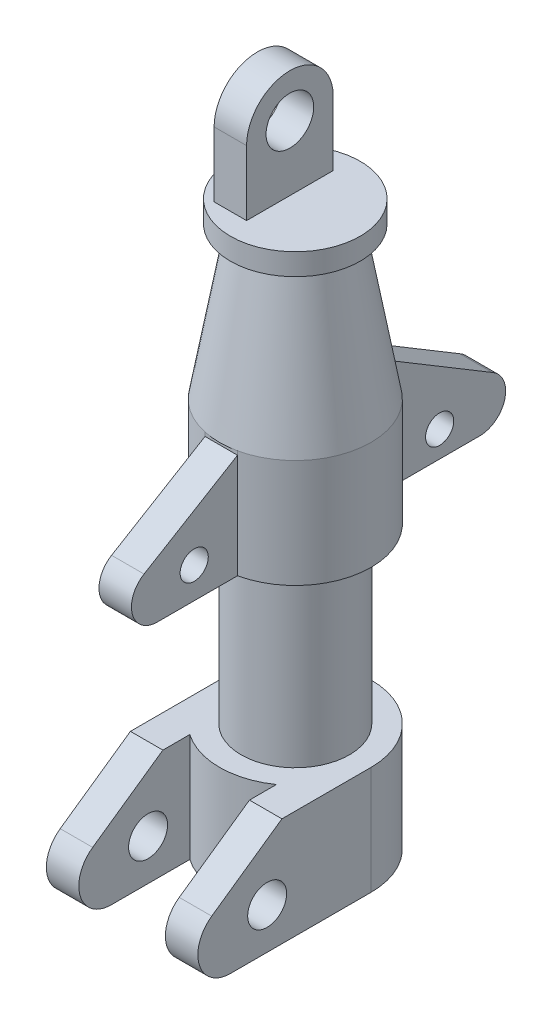
ISO-10303-21;
HEADER;
FILE_DESCRIPTION(('STEP AP214'),'2;1');
FILE_NAME('part.step','',(''),(''),'','','');
FILE_SCHEMA(('AUTOMOTIVE_DESIGN { 1 0 10303 214 1 1 1 1 }'));
ENDSEC;
DATA;
#1=APPLICATION_CONTEXT('core data for automotive mechanical design processes');
#2=APPLICATION_PROTOCOL_DEFINITION('international standard','automotive_design',2000,#1);
#3=PRODUCT_CONTEXT('',#1,'mechanical');
#4=PRODUCT('Part','Part','',(#3));
#5=PRODUCT_RELATED_PRODUCT_CATEGORY('part','',(#4));
#6=PRODUCT_DEFINITION_FORMATION('','',#4);
#7=PRODUCT_DEFINITION_CONTEXT('part definition',#1,'design');
#8=PRODUCT_DEFINITION('design','',#6,#7);
#9=PRODUCT_DEFINITION_SHAPE('','',#8);
#10=(LENGTH_UNIT() NAMED_UNIT(*) SI_UNIT(.MILLI.,.METRE.));
#11=(NAMED_UNIT(*) PLANE_ANGLE_UNIT() SI_UNIT($,.RADIAN.));
#12=(NAMED_UNIT(*) SI_UNIT($,.STERADIAN.) SOLID_ANGLE_UNIT());
#13=UNCERTAINTY_MEASURE_WITH_UNIT(LENGTH_MEASURE(1.E-05),#10,'distance_accuracy_value','');
#14=(GEOMETRIC_REPRESENTATION_CONTEXT(3) GLOBAL_UNCERTAINTY_ASSIGNED_CONTEXT((#13)) GLOBAL_UNIT_ASSIGNED_CONTEXT((#10,
#11,#12)) REPRESENTATION_CONTEXT('',''));
#15=CARTESIAN_POINT('',(0.,0.,0.));
#16=DIRECTION('',(0.,0.,1.));
#17=DIRECTION('',(1.,0.,0.));
#18=AXIS2_PLACEMENT_3D('',#15,#16,#17);
#19=CARTESIAN_POINT('',(-2.49999999999999,320.,20.));
#20=DIRECTION('',(0.,0.,-1.));
#21=DIRECTION('',(-1.,0.,0.));
#22=AXIS2_PLACEMENT_3D('',#19,#20,#21);
#23=PLANE('',#22);
#24=DIRECTION('',(-1.,0.,0.));
#25=VECTOR('',#24,1.);
#26=CARTESIAN_POINT('',(42.5,290.,20.));
#27=LINE('',#26,#25);
#28=CARTESIAN_POINT('',(-2.49999999999999,290.,20.));
#29=VERTEX_POINT('',#28);
#30=CARTESIAN_POINT('',(-17.5,290.,20.));
#31=VERTEX_POINT('',#30);
#32=EDGE_CURVE('E92',#29,#31,#27,.T.);
#33=ORIENTED_EDGE('',*,*,#32,.T.);
#34=DIRECTION('',(0.,-1.,0.));
#35=VECTOR('',#34,1.);
#36=CARTESIAN_POINT('',(-17.5,320.,20.));
#37=LINE('',#36,#35);
#38=CARTESIAN_POINT('',(-17.5,260.,20.));
#39=VERTEX_POINT('',#38);
#40=EDGE_CURVE('E246',#31,#39,#37,.T.);
#41=ORIENTED_EDGE('',*,*,#40,.T.);
#42=DIRECTION('',(1.,0.,0.));
#43=VECTOR('',#42,1.);
#44=CARTESIAN_POINT('',(-2.49999999999999,260.,20.));
#45=LINE('',#44,#43);
#46=CARTESIAN_POINT('',(-2.49999999999999,260.,20.));
#47=VERTEX_POINT('',#46);
#48=EDGE_CURVE('E463',#39,#47,#45,.T.);
#49=ORIENTED_EDGE('',*,*,#48,.T.);
#50=DIRECTION('',(0.,-1.,0.));
#51=VECTOR('',#50,1.);
#52=CARTESIAN_POINT('',(-2.49999999999999,320.,20.));
#53=LINE('',#52,#51);
#54=EDGE_CURVE('E248',#29,#47,#53,.T.);
#55=ORIENTED_EDGE('',*,*,#54,.F.);
#56=EDGE_LOOP('',(#33,#41,#49,#55));
#57=FACE_BOUND('',#56,.T.);
#58=ADVANCED_FACE('F77',(#57),#23,.F.);
#59=CARTESIAN_POINT('',(0.,260.,0.));
#60=DIRECTION('',(0.,-1.,0.));
#61=DIRECTION('',(0.,0.,-1.));
#62=AXIS2_PLACEMENT_3D('',#59,#60,#61);
#63=PLANE('',#62);
#64=CARTESIAN_POINT('',(0.,260.,0.));
#65=DIRECTION('',(0.,1.,0.));
#66=DIRECTION('',(0.,0.,1.));
#67=AXIS2_PLACEMENT_3D('',#64,#65,#66);
#68=CIRCLE('',#67,30.);
#69=CARTESIAN_POINT('',(0.,260.,30.));
#70=VERTEX_POINT('',#69);
#71=EDGE_CURVE('E430',#70,#70,#68,.T.);
#72=ORIENTED_EDGE('',*,*,#71,.T.);
#73=EDGE_LOOP('',(#72));
#74=FACE_BOUND('',#73,.T.);
#75=DIRECTION('',(-1.,0.,0.));
#76=VECTOR('',#75,1.);
#77=CARTESIAN_POINT('',(-17.5,260.,-20.));
#78=LINE('',#77,#76);
#79=CARTESIAN_POINT('',(-2.5,260.,-20.));
#80=VERTEX_POINT('',#79);
#81=CARTESIAN_POINT('',(-17.5,260.,-20.));
#82=VERTEX_POINT('',#81);
#83=EDGE_CURVE('E452',#80,#82,#78,.T.);
#84=ORIENTED_EDGE('',*,*,#83,.F.);
#85=DIRECTION('',(0.,0.,-1.));
#86=VECTOR('',#85,1.);
#87=CARTESIAN_POINT('',(-2.5,260.,-20.));
#88=LINE('',#87,#86);
#89=EDGE_CURVE('E465',#47,#80,#88,.T.);
#90=ORIENTED_EDGE('',*,*,#89,.F.);
#91=ORIENTED_EDGE('',*,*,#48,.F.);
#92=DIRECTION('',(0.,0.,1.));
#93=VECTOR('',#92,1.);
#94=CARTESIAN_POINT('',(-17.5,260.,20.));
#95=LINE('',#94,#93);
#96=EDGE_CURVE('E251',#82,#39,#95,.T.);
#97=ORIENTED_EDGE('',*,*,#96,.F.);
#98=EDGE_LOOP('',(#84,#90,#91,#97));
#99=FACE_BOUND('',#98,.T.);
#100=ADVANCED_FACE('F474',(#74,#99),#63,.F.);
#101=CARTESIAN_POINT('',(35.,130.,0.));
#102=DIRECTION('',(0.,1.,0.));
#103=DIRECTION('',(0.,0.,1.));
#104=AXIS2_PLACEMENT_3D('',#101,#102,#103);
#105=PLANE('',#104);
#106=CARTESIAN_POINT('',(0.,130.,0.));
#107=DIRECTION('',(0.,1.,0.));
#108=DIRECTION('',(0.,0.,1.));
#109=AXIS2_PLACEMENT_3D('',#106,#107,#108);
#110=CIRCLE('',#109,24.9999999999999);
#111=CARTESIAN_POINT('',(0.,130.,24.9999999999999));
#112=VERTEX_POINT('',#111);
#113=EDGE_CURVE('E411',#112,#112,#110,.T.);
#114=ORIENTED_EDGE('',*,*,#113,.T.);
#115=EDGE_LOOP('',(#114));
#116=FACE_BOUND('',#115,.T.);
#117=DIRECTION('',(0.,0.,1.));
#118=VECTOR('',#117,1.);
#119=CARTESIAN_POINT('',(7.5,130.,0.));
#120=LINE('',#119,#118);
#121=CARTESIAN_POINT('',(7.5,130.,34.1869858279433));
#122=VERTEX_POINT('',#121);
#123=CARTESIAN_POINT('',(7.50000000000003,130.,71.1869858279433));
#124=VERTEX_POINT('',#123);
#125=EDGE_CURVE('E328',#122,#124,#120,.T.);
#126=ORIENTED_EDGE('',*,*,#125,.T.);
#127=DIRECTION('',(-1.,0.,0.));
#128=VECTOR('',#127,1.);
#129=CARTESIAN_POINT('',(97.5000000000001,130.,71.1869858279433));
#130=LINE('',#129,#128);
#131=CARTESIAN_POINT('',(-7.49999999999999,130.,71.1869858279433));
#132=VERTEX_POINT('',#131);
#133=EDGE_CURVE('E277',#124,#132,#130,.T.);
#134=ORIENTED_EDGE('',*,*,#133,.T.);
#135=DIRECTION('',(0.,0.,-1.));
#136=VECTOR('',#135,1.);
#137=CARTESIAN_POINT('',(-7.49999999999999,130.,91.6628729201534));
#138=LINE('',#137,#136);
#139=CARTESIAN_POINT('',(-7.49999999999999,130.,34.1869858279433));
#140=VERTEX_POINT('',#139);
#141=EDGE_CURVE('E331',#132,#140,#138,.T.);
#142=ORIENTED_EDGE('',*,*,#141,.T.);
#143=CARTESIAN_POINT('',(0.,130.,0.));
#144=DIRECTION('',(0.,1.,0.));
#145=DIRECTION('',(0.,0.,1.));
#146=AXIS2_PLACEMENT_3D('',#143,#144,#145);
#147=CIRCLE('',#146,35.);
#148=CARTESIAN_POINT('',(-7.49999999999999,130.,-34.1869858279433));
#149=VERTEX_POINT('',#148);
#150=EDGE_CURVE('E414',#149,#140,#147,.T.);
#151=ORIENTED_EDGE('',*,*,#150,.F.);
#152=DIRECTION('',(0.,0.,-1.));
#153=VECTOR('',#152,1.);
#154=CARTESIAN_POINT('',(-7.49999999999999,130.,-9.97430529099572));
#155=LINE('',#154,#153);
#156=CARTESIAN_POINT('',(-7.49999999999999,130.,-77.6869858279433));
#157=VERTEX_POINT('',#156);
#158=EDGE_CURVE('E313',#149,#157,#155,.T.);
#159=ORIENTED_EDGE('',*,*,#158,.T.);
#160=DIRECTION('',(-1.,0.,0.));
#161=VECTOR('',#160,1.);
#162=CARTESIAN_POINT('',(97.5000000000001,130.,-77.6869858279433));
#163=LINE('',#162,#161);
#164=CARTESIAN_POINT('',(7.50000000000003,130.,-77.6869858279433));
#165=VERTEX_POINT('',#164);
#166=EDGE_CURVE('E294',#165,#157,#163,.T.);
#167=ORIENTED_EDGE('',*,*,#166,.F.);
#168=DIRECTION('',(0.,0.,1.));
#169=VECTOR('',#168,1.);
#170=CARTESIAN_POINT('',(7.50000000000001,130.,-91.6628729201534));
#171=LINE('',#170,#169);
#172=CARTESIAN_POINT('',(7.50000000000001,130.,-34.1869858279433));
#173=VERTEX_POINT('',#172);
#174=EDGE_CURVE('E316',#165,#173,#171,.T.);
#175=ORIENTED_EDGE('',*,*,#174,.T.);
#176=EDGE_CURVE('E415',#122,#173,#147,.T.);
#177=ORIENTED_EDGE('',*,*,#176,.F.);
#178=EDGE_LOOP('',(#126,#134,#142,#151,#159,#167,#175,#177));
#179=FACE_BOUND('',#178,.T.);
#180=ADVANCED_FACE('F491',(#116,#179),#105,.F.);
#181=CARTESIAN_POINT('',(7.5,37.1179119960356,0.));
#182=DIRECTION('',(1.,0.,0.));
#183=DIRECTION('',(0.,0.,-1.));
#184=AXIS2_PLACEMENT_3D('',#181,#182,#183);
#185=PLANE('',#184);
#186=CARTESIAN_POINT('',(7.50000000000001,144.29,54.1869858279433));
#187=DIRECTION('',(1.,0.,0.));
#188=DIRECTION('',(0.,0.,-1.));
#189=AXIS2_PLACEMENT_3D('',#186,#187,#188);
#190=CIRCLE('',#189,6.50000000000001);
#191=CARTESIAN_POINT('',(7.50000000000001,144.29,47.6869858279433));
#192=VERTEX_POINT('',#191);
#193=EDGE_CURVE('E305',#192,#192,#190,.T.);
#194=ORIENTED_EDGE('',*,*,#193,.F.);
#195=EDGE_LOOP('',(#194));
#196=FACE_BOUND('',#195,.T.);
#197=DIRECTION('',(0.,0.515038074910049,-0.857167300702115));
#198=VECTOR('',#197,1.);
#199=CARTESIAN_POINT('',(7.50000000000001,155.89173137801,71.36651063812));
#200=LINE('',#199,#198);
#201=CARTESIAN_POINT('',(7.50000000000003,152.286007608425,77.367442726864));
#202=VERTEX_POINT('',#201);
#203=CARTESIAN_POINT('',(7.50000000000003,178.231443670603,34.1869858279433));
#204=VERTEX_POINT('',#203);
#205=EDGE_CURVE('E308',#202,#204,#200,.T.);
#206=ORIENTED_EDGE('',*,*,#205,.F.);
#207=CARTESIAN_POINT('',(7.50000000000002,142.,71.1869858279433));
#208=DIRECTION('',(1.,0.,0.));
#209=DIRECTION('',(0.,0.,-1.));
#210=AXIS2_PLACEMENT_3D('',#207,#208,#209);
#211=CIRCLE('',#210,12.);
#212=EDGE_CURVE('E310',#202,#124,#211,.T.);
#213=ORIENTED_EDGE('',*,*,#212,.T.);
#214=ORIENTED_EDGE('',*,*,#125,.F.);
#215=DIRECTION('',(0.,1.,0.));
#216=VECTOR('',#215,1.);
#217=CARTESIAN_POINT('',(7.5,462.148353896807,34.1869858279433));
#218=LINE('',#217,#216);
#219=EDGE_CURVE('E336',#204,#122,#218,.F.);
#220=ORIENTED_EDGE('',*,*,#219,.F.);
#221=EDGE_LOOP('',(#206,#213,#214,#220));
#222=FACE_BOUND('',#221,.T.);
#223=ADVANCED_FACE('F552',(#196,#222),#185,.T.);
#224=CARTESIAN_POINT('',(-7.49999999999999,37.1179119960356,91.6628729201534));
#225=DIRECTION('',(-1.,0.,0.));
#226=DIRECTION('',(0.,0.,1.));
#227=AXIS2_PLACEMENT_3D('',#224,#225,#226);
#228=PLANE('',#227);
#229=CARTESIAN_POINT('',(-7.49999999999999,144.29,54.1869858279433));
#230=DIRECTION('',(-1.,0.,0.));
#231=DIRECTION('',(0.,0.,1.));
#232=AXIS2_PLACEMENT_3D('',#229,#230,#231);
#233=CIRCLE('',#232,6.50000000000001);
#234=CARTESIAN_POINT('',(-7.49999999999999,144.29,60.6869858279434));
#235=VERTEX_POINT('',#234);
#236=EDGE_CURVE('E265',#235,#235,#233,.T.);
#237=ORIENTED_EDGE('',*,*,#236,.F.);
#238=EDGE_LOOP('',(#237));
#239=FACE_BOUND('',#238,.T.);
#240=ORIENTED_EDGE('',*,*,#141,.F.);
#241=CARTESIAN_POINT('',(-7.49999999999999,142.,71.1869858279433));
#242=DIRECTION('',(-1.,0.,0.));
#243=DIRECTION('',(0.,0.,1.));
#244=AXIS2_PLACEMENT_3D('',#241,#242,#243);
#245=CIRCLE('',#244,12.);
#246=CARTESIAN_POINT('',(-7.49999999999999,152.286007608425,77.367442726864));
#247=VERTEX_POINT('',#246);
#248=EDGE_CURVE('E268',#132,#247,#245,.T.);
#249=ORIENTED_EDGE('',*,*,#248,.T.);
#250=DIRECTION('',(0.,-0.515038074910049,0.857167300702116));
#251=VECTOR('',#250,1.);
#252=CARTESIAN_POINT('',(-7.49999999999999,146.045677456057,87.7530961625445));
#253=LINE('',#252,#251);
#254=CARTESIAN_POINT('',(-7.49999999999999,178.231443670603,34.1869858279433));
#255=VERTEX_POINT('',#254);
#256=EDGE_CURVE('E274',#255,#247,#253,.T.);
#257=ORIENTED_EDGE('',*,*,#256,.F.);
#258=DIRECTION('',(0.,1.,0.));
#259=VECTOR('',#258,1.);
#260=CARTESIAN_POINT('',(-7.49999999999999,462.148353896807,34.1869858279433));
#261=LINE('',#260,#259);
#262=EDGE_CURVE('E333',#140,#255,#261,.T.);
#263=ORIENTED_EDGE('',*,*,#262,.F.);
#264=EDGE_LOOP('',(#240,#249,#257,#263));
#265=FACE_BOUND('',#264,.T.);
#266=ADVANCED_FACE('F546',(#239,#265),#228,.T.);
#267=CARTESIAN_POINT('',(7.50000000000001,37.1179119960356,-91.6628729201534));
#268=DIRECTION('',(1.,0.,0.));
#269=DIRECTION('',(0.,0.,-1.));
#270=AXIS2_PLACEMENT_3D('',#267,#268,#269);
#271=PLANE('',#270);
#272=CARTESIAN_POINT('',(7.50000000000001,142.,-59.1869858279433));
#273=DIRECTION('',(1.,0.,0.));
#274=DIRECTION('',(0.,0.,-1.));
#275=AXIS2_PLACEMENT_3D('',#272,#273,#274);
#276=CIRCLE('',#275,6.50000000000001);
#277=CARTESIAN_POINT('',(7.50000000000001,142.,-65.6869858279433));
#278=VERTEX_POINT('',#277);
#279=EDGE_CURVE('E302',#278,#278,#276,.T.);
#280=ORIENTED_EDGE('',*,*,#279,.F.);
#281=EDGE_LOOP('',(#280));
#282=FACE_BOUND('',#281,.T.);
#283=ORIENTED_EDGE('',*,*,#174,.F.);
#284=CARTESIAN_POINT('',(7.50000000000001,142.,-77.6869858279433));
#285=DIRECTION('',(1.,0.,0.));
#286=DIRECTION('',(0.,0.,-1.));
#287=AXIS2_PLACEMENT_3D('',#284,#285,#286);
#288=CIRCLE('',#287,12.);
#289=CARTESIAN_POINT('',(7.50000000000003,152.480329711502,-83.531871552934));
#290=VERTEX_POINT('',#289);
#291=EDGE_CURVE('E299',#165,#290,#288,.T.);
#292=ORIENTED_EDGE('',*,*,#291,.T.);
#293=DIRECTION('',(0.,-0.515038074910049,-0.857167300702115));
#294=VECTOR('',#293,1.);
#295=CARTESIAN_POINT('',(7.50000000000001,118.28918407723,-140.435493710114));
#296=LINE('',#295,#294);
#297=CARTESIAN_POINT('',(7.50000000000003,180.,-37.7314489307359));
#298=VERTEX_POINT('',#297);
#299=EDGE_CURVE('E296',#298,#290,#296,.T.);
#300=ORIENTED_EDGE('',*,*,#299,.F.);
#301=DIRECTION('',(0.,0.,-1.));
#302=VECTOR('',#301,1.);
#303=CARTESIAN_POINT('',(7.50000000000001,180.,-91.6628729201534));
#304=LINE('',#303,#302);
#305=CARTESIAN_POINT('',(7.50000000000001,180.,-34.1869858279433));
#306=VERTEX_POINT('',#305);
#307=EDGE_CURVE('E317',#306,#298,#304,.T.);
#308=ORIENTED_EDGE('',*,*,#307,.F.);
#309=DIRECTION('',(0.,1.,0.));
#310=VECTOR('',#309,1.);
#311=CARTESIAN_POINT('',(7.50000000000001,462.148353896807,-34.1869858279433));
#312=LINE('',#311,#310);
#313=EDGE_CURVE('E326',#173,#306,#312,.T.);
#314=ORIENTED_EDGE('',*,*,#313,.F.);
#315=EDGE_LOOP('',(#283,#292,#300,#308,#314));
#316=FACE_BOUND('',#315,.T.);
#317=ADVANCED_FACE('F542',(#282,#316),#271,.T.);
#318=CARTESIAN_POINT('',(-7.49999999999999,37.1179119960356,-9.97430529099572));
#319=DIRECTION('',(-1.,0.,0.));
#320=DIRECTION('',(0.,0.,1.));
#321=AXIS2_PLACEMENT_3D('',#318,#319,#320);
#322=PLANE('',#321);
#323=CARTESIAN_POINT('',(-7.49999999999999,142.,-59.1869858279433));
#324=DIRECTION('',(-1.,0.,0.));
#325=DIRECTION('',(0.,0.,1.));
#326=AXIS2_PLACEMENT_3D('',#323,#324,#325);
#327=CIRCLE('',#326,6.50000000000001);
#328=CARTESIAN_POINT('',(-7.49999999999999,142.,-52.6869858279433));
#329=VERTEX_POINT('',#328);
#330=EDGE_CURVE('E262',#329,#329,#327,.T.);
#331=ORIENTED_EDGE('',*,*,#330,.F.);
#332=EDGE_LOOP('',(#331));
#333=FACE_BOUND('',#332,.T.);
#334=DIRECTION('',(0.,0.515038074910049,0.857167300702115));
#335=VECTOR('',#334,1.);
#336=CARTESIAN_POINT('',(-7.49999999999999,148.909886654967,-89.4740866748264));
#337=LINE('',#336,#335);
#338=CARTESIAN_POINT('',(-7.49999999999999,152.480329711502,-83.531871552934));
#339=VERTEX_POINT('',#338);
#340=CARTESIAN_POINT('',(-7.49999999999999,180.,-37.7314489307359));
#341=VERTEX_POINT('',#340);
#342=EDGE_CURVE('E291',#339,#341,#337,.T.);
#343=ORIENTED_EDGE('',*,*,#342,.F.);
#344=CARTESIAN_POINT('',(-7.49999999999999,142.,-77.6869858279433));
#345=DIRECTION('',(-1.,0.,0.));
#346=DIRECTION('',(0.,0.,1.));
#347=AXIS2_PLACEMENT_3D('',#344,#345,#346);
#348=CIRCLE('',#347,12.);
#349=EDGE_CURVE('E280',#339,#157,#348,.T.);
#350=ORIENTED_EDGE('',*,*,#349,.T.);
#351=ORIENTED_EDGE('',*,*,#158,.F.);
#352=DIRECTION('',(0.,1.,0.));
#353=VECTOR('',#352,1.);
#354=CARTESIAN_POINT('',(-7.49999999999999,462.148353896807,-34.1869858279433));
#355=LINE('',#354,#353);
#356=CARTESIAN_POINT('',(-7.49999999999999,180.,-34.1869858279433));
#357=VERTEX_POINT('',#356);
#358=EDGE_CURVE('E322',#357,#149,#355,.F.);
#359=ORIENTED_EDGE('',*,*,#358,.F.);
#360=DIRECTION('',(0.,0.,1.));
#361=VECTOR('',#360,1.);
#362=CARTESIAN_POINT('',(-7.49999999999999,180.,-9.97430529099572));
#363=LINE('',#362,#361);
#364=EDGE_CURVE('E320',#341,#357,#363,.T.);
#365=ORIENTED_EDGE('',*,*,#364,.F.);
#366=EDGE_LOOP('',(#343,#350,#351,#359,#365));
#367=FACE_BOUND('',#366,.T.);
#368=ADVANCED_FACE('F538',(#333,#367),#322,.T.);
#369=CARTESIAN_POINT('',(0.,462.148353896807,0.));
#370=DIRECTION('',(0.,1.,0.));
#371=DIRECTION('',(0.,0.,1.));
#372=AXIS2_PLACEMENT_3D('',#369,#370,#371);
#373=CYLINDRICAL_SURFACE('',#372,35.);
#374=ORIENTED_EDGE('',*,*,#176,.T.);
#375=ORIENTED_EDGE('',*,*,#313,.T.);
#376=CARTESIAN_POINT('',(0.,180.,0.));
#377=DIRECTION('',(0.,1.,0.));
#378=DIRECTION('',(0.,0.,1.));
#379=AXIS2_PLACEMENT_3D('',#376,#377,#378);
#380=CIRCLE('',#379,35.);
#381=CARTESIAN_POINT('',(7.50000000000003,180.,34.1869858279433));
#382=VERTEX_POINT('',#381);
#383=EDGE_CURVE('E419',#382,#306,#380,.T.);
#384=ORIENTED_EDGE('',*,*,#383,.F.);
#385=EDGE_CURVE('E337',#382,#204,#218,.F.);
#386=ORIENTED_EDGE('',*,*,#385,.T.);
#387=ORIENTED_EDGE('',*,*,#219,.T.);
#388=EDGE_LOOP('',(#374,#375,#384,#386,#387));
#389=FACE_BOUND('',#388,.T.);
#390=ADVANCED_FACE('F541',(#389),#373,.T.);
#391=CARTESIAN_POINT('',(35.,0.,0.));
#392=DIRECTION('',(0.,1.,0.));
#393=DIRECTION('',(0.,0.,1.));
#394=AXIS2_PLACEMENT_3D('',#391,#392,#393);
#395=PLANE('',#394);
#396=CARTESIAN_POINT('',(0.,0.,0.));
#397=DIRECTION('',(0.,-1.,0.));
#398=DIRECTION('',(0.,0.,-1.));
#399=AXIS2_PLACEMENT_3D('',#396,#397,#398);
#400=CIRCLE('',#399,20.);
#401=CARTESIAN_POINT('',(0.,0.,-20.));
#402=VERTEX_POINT('',#401);
#403=EDGE_CURVE('E253',#402,#402,#400,.T.);
#404=ORIENTED_EDGE('',*,*,#403,.F.);
#405=EDGE_LOOP('',(#404));
#406=FACE_BOUND('',#405,.T.);
#407=DIRECTION('',(-1.,0.,0.));
#408=VECTOR('',#407,1.);
#409=CARTESIAN_POINT('',(70.,0.,65.));
#410=LINE('',#409,#408);
#411=CARTESIAN_POINT('',(-20.,0.,65.));
#412=VERTEX_POINT('',#411);
#413=CARTESIAN_POINT('',(-35.,0.,65.));
#414=VERTEX_POINT('',#413);
#415=EDGE_CURVE('E340',#412,#414,#410,.T.);
#416=ORIENTED_EDGE('',*,*,#415,.T.);
#417=DIRECTION('',(0.,0.,1.));
#418=VECTOR('',#417,1.);
#419=CARTESIAN_POINT('',(-35.,0.,0.));
#420=LINE('',#419,#418);
#421=CARTESIAN_POINT('',(-35.,0.,0.));
#422=VERTEX_POINT('',#421);
#423=EDGE_CURVE('E392',#422,#414,#420,.T.);
#424=ORIENTED_EDGE('',*,*,#423,.F.);
#425=CARTESIAN_POINT('',(0.,0.,0.));
#426=DIRECTION('',(0.,1.,0.));
#427=DIRECTION('',(0.,0.,1.));
#428=AXIS2_PLACEMENT_3D('',#425,#426,#427);
#429=CIRCLE('',#428,35.);
#430=CARTESIAN_POINT('',(35.,0.,0.));
#431=VERTEX_POINT('',#430);
#432=EDGE_CURVE('E433',#431,#422,#429,.T.);
#433=ORIENTED_EDGE('',*,*,#432,.F.);
#434=DIRECTION('',(0.,0.,-1.));
#435=VECTOR('',#434,1.);
#436=CARTESIAN_POINT('',(35.,0.,0.));
#437=LINE('',#436,#435);
#438=CARTESIAN_POINT('',(35.,0.,65.));
#439=VERTEX_POINT('',#438);
#440=EDGE_CURVE('E385',#439,#431,#437,.T.);
#441=ORIENTED_EDGE('',*,*,#440,.F.);
#442=CARTESIAN_POINT('',(20.,0.,65.));
#443=VERTEX_POINT('',#442);
#444=EDGE_CURVE('E347',#439,#443,#410,.T.);
#445=ORIENTED_EDGE('',*,*,#444,.T.);
#446=DIRECTION('',(0.,0.,1.));
#447=VECTOR('',#446,1.);
#448=CARTESIAN_POINT('',(20.,0.,93.1948905672471));
#449=LINE('',#448,#447);
#450=CARTESIAN_POINT('',(20.,0.,28.7228132326902));
#451=VERTEX_POINT('',#450);
#452=EDGE_CURVE('E381',#451,#443,#449,.T.);
#453=ORIENTED_EDGE('',*,*,#452,.F.);
#454=CARTESIAN_POINT('',(-20.,0.,28.7228132326902));
#455=VERTEX_POINT('',#454);
#456=EDGE_CURVE('E434',#455,#451,#429,.T.);
#457=ORIENTED_EDGE('',*,*,#456,.F.);
#458=DIRECTION('',(0.,0.,-1.));
#459=VECTOR('',#458,1.);
#460=CARTESIAN_POINT('',(-20.,0.,93.1948905672471));
#461=LINE('',#460,#459);
#462=EDGE_CURVE('E399',#412,#455,#461,.T.);
#463=ORIENTED_EDGE('',*,*,#462,.F.);
#464=EDGE_LOOP('',(#416,#424,#433,#441,#445,#453,#457,#463));
#465=FACE_BOUND('',#464,.T.);
#466=ADVANCED_FACE('F612',(#406,#465),#395,.F.);
#467=CARTESIAN_POINT('',(0.,462.148353896807,0.));
#468=DIRECTION('',(0.,1.,0.));
#469=DIRECTION('',(0.,0.,1.));
#470=AXIS2_PLACEMENT_3D('',#467,#468,#469);
#471=CYLINDRICAL_SURFACE('',#470,35.);
#472=DIRECTION('',(0.,1.,0.));
#473=VECTOR('',#472,1.);
#474=CARTESIAN_POINT('',(20.,462.148353896807,28.7228132326901));
#475=LINE('',#474,#473);
#476=CARTESIAN_POINT('',(20.,50.,28.7228132326901));
#477=VERTEX_POINT('',#476);
#478=EDGE_CURVE('E387',#477,#451,#475,.F.);
#479=ORIENTED_EDGE('',*,*,#478,.F.);
#480=CARTESIAN_POINT('',(0.,50.,0.));
#481=DIRECTION('',(0.,1.,0.));
#482=DIRECTION('',(0.,0.,1.));
#483=AXIS2_PLACEMENT_3D('',#480,#481,#482);
#484=CIRCLE('',#483,35.);
#485=CARTESIAN_POINT('',(-20.,50.,28.7228132326901));
#486=VERTEX_POINT('',#485);
#487=EDGE_CURVE('E438',#486,#477,#484,.T.);
#488=ORIENTED_EDGE('',*,*,#487,.F.);
#489=DIRECTION('',(0.,1.,0.));
#490=VECTOR('',#489,1.);
#491=CARTESIAN_POINT('',(-20.,462.148353896807,28.7228132326901));
#492=LINE('',#491,#490);
#493=EDGE_CURVE('E395',#455,#486,#492,.T.);
#494=ORIENTED_EDGE('',*,*,#493,.F.);
#495=ORIENTED_EDGE('',*,*,#456,.T.);
#496=EDGE_LOOP('',(#479,#488,#494,#495));
#497=FACE_BOUND('',#496,.T.);
#498=ADVANCED_FACE('F614',(#497),#471,.T.);
#499=DIRECTION('',(0.,-1.,0.));
#500=VECTOR('',#499,1.);
#501=CARTESIAN_POINT('',(35.,144.39431989183,0.));
#502=LINE('',#501,#500);
#503=CARTESIAN_POINT('',(35.,50.,0.));
#504=VERTEX_POINT('',#503);
#505=EDGE_CURVE('E378',#504,#431,#502,.T.);
#506=ORIENTED_EDGE('',*,*,#505,.T.);
#507=ORIENTED_EDGE('',*,*,#432,.T.);
#508=DIRECTION('',(0.,-1.,0.));
#509=VECTOR('',#508,1.);
#510=CARTESIAN_POINT('',(-35.,144.39431989183,0.));
#511=LINE('',#510,#509);
#512=CARTESIAN_POINT('',(-35.,50.,0.));
#513=VERTEX_POINT('',#512);
#514=EDGE_CURVE('E401',#513,#422,#511,.T.);
#515=ORIENTED_EDGE('',*,*,#514,.F.);
#516=EDGE_CURVE('E437',#504,#513,#484,.T.);
#517=ORIENTED_EDGE('',*,*,#516,.F.);
#518=EDGE_LOOP('',(#506,#507,#515,#517));
#519=FACE_BOUND('',#518,.T.);
#520=ADVANCED_FACE('F617',(#519),#471,.T.);
#521=CARTESIAN_POINT('',(24.9999999999999,50.,0.));
#522=DIRECTION('',(0.,-1.,0.));
#523=DIRECTION('',(0.,0.,-1.));
#524=AXIS2_PLACEMENT_3D('',#521,#522,#523);
#525=PLANE('',#524);
#526=DIRECTION('',(0.,0.,-1.));
#527=VECTOR('',#526,1.);
#528=CARTESIAN_POINT('',(-35.,50.,0.));
#529=LINE('',#528,#527);
#530=CARTESIAN_POINT('',(-35.,50.,41.1665216983425));
#531=VERTEX_POINT('',#530);
#532=EDGE_CURVE('E393',#531,#513,#529,.T.);
#533=ORIENTED_EDGE('',*,*,#532,.F.);
#534=DIRECTION('',(-1.,0.,0.));
#535=VECTOR('',#534,1.);
#536=CARTESIAN_POINT('',(70.,50.,41.1665216983425));
#537=LINE('',#536,#535);
#538=CARTESIAN_POINT('',(-20.,50.,41.1665216983425));
#539=VERTEX_POINT('',#538);
#540=EDGE_CURVE('E341',#539,#531,#537,.T.);
#541=ORIENTED_EDGE('',*,*,#540,.F.);
#542=DIRECTION('',(0.,0.,1.));
#543=VECTOR('',#542,1.);
#544=CARTESIAN_POINT('',(-20.,50.,93.1948905672471));
#545=LINE('',#544,#543);
#546=EDGE_CURVE('E396',#486,#539,#545,.T.);
#547=ORIENTED_EDGE('',*,*,#546,.F.);
#548=ORIENTED_EDGE('',*,*,#487,.T.);
#549=DIRECTION('',(0.,0.,-1.));
#550=VECTOR('',#549,1.);
#551=CARTESIAN_POINT('',(20.,50.,93.1948905672471));
#552=LINE('',#551,#550);
#553=CARTESIAN_POINT('',(20.,50.,41.1665216983425));
#554=VERTEX_POINT('',#553);
#555=EDGE_CURVE('E382',#554,#477,#552,.T.);
#556=ORIENTED_EDGE('',*,*,#555,.F.);
#557=CARTESIAN_POINT('',(35.,50.,41.1665216983425));
#558=VERTEX_POINT('',#557);
#559=EDGE_CURVE('E343',#558,#554,#537,.T.);
#560=ORIENTED_EDGE('',*,*,#559,.F.);
#561=DIRECTION('',(0.,0.,1.));
#562=VECTOR('',#561,1.);
#563=CARTESIAN_POINT('',(35.,50.,0.));
#564=LINE('',#563,#562);
#565=EDGE_CURVE('E377',#504,#558,#564,.T.);
#566=ORIENTED_EDGE('',*,*,#565,.F.);
#567=ORIENTED_EDGE('',*,*,#516,.T.);
#568=EDGE_LOOP('',(#533,#541,#547,#548,#556,#560,#566,#567));
#569=FACE_BOUND('',#568,.T.);
#570=CARTESIAN_POINT('',(0.,50.,0.));
#571=DIRECTION('',(0.,1.,0.));
#572=DIRECTION('',(0.,0.,1.));
#573=AXIS2_PLACEMENT_3D('',#570,#571,#572);
#574=CIRCLE('',#573,24.9999999999999);
#575=CARTESIAN_POINT('',(0.,50.,24.9999999999999));
#576=VERTEX_POINT('',#575);
#577=EDGE_CURVE('E408',#576,#576,#574,.T.);
#578=ORIENTED_EDGE('',*,*,#577,.F.);
#579=EDGE_LOOP('',(#578));
#580=FACE_BOUND('',#579,.T.);
#581=ADVANCED_FACE('F79',(#569,#580),#525,.F.);
#582=CARTESIAN_POINT('',(0.,462.148353896807,0.));
#583=DIRECTION('',(0.,1.,0.));
#584=DIRECTION('',(0.,0.,1.));
#585=AXIS2_PLACEMENT_3D('',#582,#583,#584);
#586=CYLINDRICAL_SURFACE('',#585,30.);
#587=ORIENTED_EDGE('',*,*,#71,.F.);
#588=EDGE_LOOP('',(#587));
#589=FACE_BOUND('',#588,.T.);
#590=CARTESIAN_POINT('',(0.,250.,0.));
#591=DIRECTION('',(0.,1.,0.));
#592=DIRECTION('',(0.,0.,1.));
#593=AXIS2_PLACEMENT_3D('',#590,#591,#592);
#594=CIRCLE('',#593,30.);
#595=CARTESIAN_POINT('',(0.,250.,30.));
#596=VERTEX_POINT('',#595);
#597=EDGE_CURVE('E427',#596,#596,#594,.T.);
#598=ORIENTED_EDGE('',*,*,#597,.T.);
#599=EDGE_LOOP('',(#598));
#600=FACE_BOUND('',#599,.T.);
#601=ADVANCED_FACE('F607',(#589,#600),#586,.T.);
#602=CARTESIAN_POINT('',(30.,250.,0.));
#603=DIRECTION('',(0.,1.,0.));
#604=DIRECTION('',(0.,0.,1.));
#605=AXIS2_PLACEMENT_3D('',#602,#603,#604);
#606=PLANE('',#605);
#607=ORIENTED_EDGE('',*,*,#597,.F.);
#608=EDGE_LOOP('',(#607));
#609=FACE_BOUND('',#608,.T.);
#610=CARTESIAN_POINT('',(0.,250.,0.));
#611=DIRECTION('',(0.,1.,0.));
#612=DIRECTION('',(0.,0.,1.));
#613=AXIS2_PLACEMENT_3D('',#610,#611,#612);
#614=CIRCLE('',#613,22.6571113504073);
#615=CARTESIAN_POINT('',(0.,250.,22.6571113504073));
#616=VERTEX_POINT('',#615);
#617=EDGE_CURVE('E422',#616,#616,#614,.T.);
#618=ORIENTED_EDGE('',*,*,#617,.T.);
#619=EDGE_LOOP('',(#618));
#620=FACE_BOUND('',#619,.T.);
#621=ADVANCED_FACE('F603',(#609,#620),#606,.F.);
#622=CARTESIAN_POINT('',(0.,180.,0.));
#623=DIRECTION('',(0.,-1.,0.));
#624=DIRECTION('',(0.,0.,-1.));
#625=AXIS2_PLACEMENT_3D('',#622,#623,#624);
#626=CONICAL_SURFACE('',#625,35.,0.174532925199435);
#627=ORIENTED_EDGE('',*,*,#617,.F.);
#628=EDGE_LOOP('',(#627));
#629=FACE_BOUND('',#628,.T.);
#630=ORIENTED_EDGE('',*,*,#383,.T.);
#631=EDGE_CURVE('E423',#306,#357,#380,.T.);
#632=ORIENTED_EDGE('',*,*,#631,.T.);
#633=CARTESIAN_POINT('',(-7.49999999999999,180.,34.1869858279433));
#634=VERTEX_POINT('',#633);
#635=EDGE_CURVE('E424',#357,#634,#380,.T.);
#636=ORIENTED_EDGE('',*,*,#635,.T.);
#637=EDGE_CURVE('E418',#634,#382,#380,.T.);
#638=ORIENTED_EDGE('',*,*,#637,.T.);
#639=EDGE_LOOP('',(#630,#632,#636,#638));
#640=FACE_BOUND('',#639,.T.);
#641=ADVANCED_FACE('F599',(#629,#640),#626,.T.);
#642=ORIENTED_EDGE('',*,*,#635,.F.);
#643=ORIENTED_EDGE('',*,*,#358,.T.);
#644=ORIENTED_EDGE('',*,*,#150,.T.);
#645=ORIENTED_EDGE('',*,*,#262,.T.);
#646=DIRECTION('',(0.,-1.,0.));
#647=VECTOR('',#646,1.);
#648=CARTESIAN_POINT('',(-7.49999999999999,0.,34.1869858279433));
#649=LINE('',#648,#647);
#650=EDGE_CURVE('E271',#634,#255,#649,.T.);
#651=ORIENTED_EDGE('',*,*,#650,.F.);
#652=EDGE_LOOP('',(#642,#643,#644,#645,#651));
#653=FACE_BOUND('',#652,.T.);
#654=ADVANCED_FACE('F592',(#653),#373,.T.);
#655=CARTESIAN_POINT('',(0.,462.148353896807,0.));
#656=DIRECTION('',(0.,1.,0.));
#657=DIRECTION('',(0.,0.,1.));
#658=AXIS2_PLACEMENT_3D('',#655,#656,#657);
#659=CYLINDRICAL_SURFACE('',#658,24.9999999999999);
#660=ORIENTED_EDGE('',*,*,#113,.F.);
#661=EDGE_LOOP('',(#660));
#662=FACE_BOUND('',#661,.T.);
#663=ORIENTED_EDGE('',*,*,#577,.T.);
#664=EDGE_LOOP('',(#663));
#665=FACE_BOUND('',#664,.T.);
#666=ADVANCED_FACE('F585',(#662,#665),#659,.T.);
#667=CARTESIAN_POINT('',(-20.,144.39431989183,93.1948905672471));
#668=DIRECTION('',(-1.,0.,0.));
#669=DIRECTION('',(0.,0.,1.));
#670=AXIS2_PLACEMENT_3D('',#667,#668,#669);
#671=PLANE('',#670);
#672=CARTESIAN_POINT('',(-20.,19.,48.));
#673=DIRECTION('',(-1.,0.,0.));
#674=DIRECTION('',(0.,0.,1.));
#675=AXIS2_PLACEMENT_3D('',#672,#673,#674);
#676=CIRCLE('',#675,9.);
#677=CARTESIAN_POINT('',(-20.,19.,57.));
#678=VERTEX_POINT('',#677);
#679=EDGE_CURVE('E362',#678,#678,#676,.T.);
#680=ORIENTED_EDGE('',*,*,#679,.T.);
#681=EDGE_LOOP('',(#680));
#682=FACE_BOUND('',#681,.T.);
#683=DIRECTION('',(0.,-0.573576436351047,0.819152044288991));
#684=VECTOR('',#683,1.);
#685=CARTESIAN_POINT('',(-20.,56.6094433878304,31.7272582983378));
#686=LINE('',#685,#684);
#687=CARTESIAN_POINT('',(-20.,27.2872806643349,73.6036465452657));
#688=VERTEX_POINT('',#687);
#689=EDGE_CURVE('E368',#539,#688,#686,.T.);
#690=ORIENTED_EDGE('',*,*,#689,.T.);
#691=CARTESIAN_POINT('',(-20.,15.,65.));
#692=DIRECTION('',(-1.,0.,0.));
#693=DIRECTION('',(0.,0.,1.));
#694=AXIS2_PLACEMENT_3D('',#691,#692,#693);
#695=CIRCLE('',#694,15.);
#696=EDGE_CURVE('E374',#688,#412,#695,.F.);
#697=ORIENTED_EDGE('',*,*,#696,.T.);
#698=ORIENTED_EDGE('',*,*,#462,.T.);
#699=ORIENTED_EDGE('',*,*,#493,.T.);
#700=ORIENTED_EDGE('',*,*,#546,.T.);
#701=EDGE_LOOP('',(#690,#697,#698,#699,#700));
#702=FACE_BOUND('',#701,.T.);
#703=ADVANCED_FACE('F582',(#682,#702),#671,.F.);
#704=CARTESIAN_POINT('',(-35.,144.39431989183,0.));
#705=DIRECTION('',(1.,0.,0.));
#706=DIRECTION('',(0.,0.,-1.));
#707=AXIS2_PLACEMENT_3D('',#704,#705,#706);
#708=PLANE('',#707);
#709=CARTESIAN_POINT('',(-35.,19.,48.));
#710=DIRECTION('',(-1.,0.,0.));
#711=DIRECTION('',(0.,0.,1.));
#712=AXIS2_PLACEMENT_3D('',#709,#710,#711);
#713=CIRCLE('',#712,9.);
#714=CARTESIAN_POINT('',(-35.,19.,57.));
#715=VERTEX_POINT('',#714);
#716=EDGE_CURVE('E355',#715,#715,#713,.T.);
#717=ORIENTED_EDGE('',*,*,#716,.F.);
#718=EDGE_LOOP('',(#717));
#719=FACE_BOUND('',#718,.T.);
#720=ORIENTED_EDGE('',*,*,#423,.T.);
#721=CARTESIAN_POINT('',(-35.,15.,65.));
#722=DIRECTION('',(1.,0.,0.));
#723=DIRECTION('',(0.,0.,1.));
#724=AXIS2_PLACEMENT_3D('',#721,#722,#723);
#725=CIRCLE('',#724,15.);
#726=CARTESIAN_POINT('',(-35.,27.2872806643349,73.6036465452657));
#727=VERTEX_POINT('',#726);
#728=EDGE_CURVE('E350',#727,#414,#725,.T.);
#729=ORIENTED_EDGE('',*,*,#728,.F.);
#730=DIRECTION('',(0.,-0.573576436351047,0.819152044288991));
#731=VECTOR('',#730,1.);
#732=CARTESIAN_POINT('',(-35.,27.2872806643349,73.6036465452657));
#733=LINE('',#732,#731);
#734=EDGE_CURVE('E352',#531,#727,#733,.T.);
#735=ORIENTED_EDGE('',*,*,#734,.F.);
#736=ORIENTED_EDGE('',*,*,#532,.T.);
#737=ORIENTED_EDGE('',*,*,#514,.T.);
#738=EDGE_LOOP('',(#720,#729,#735,#736,#737));
#739=FACE_BOUND('',#738,.T.);
#740=ADVANCED_FACE('F580',(#719,#739),#708,.F.);
#741=CARTESIAN_POINT('',(20.,144.39431989183,93.1948905672471));
#742=DIRECTION('',(1.,0.,0.));
#743=DIRECTION('',(0.,0.,-1.));
#744=AXIS2_PLACEMENT_3D('',#741,#742,#743);
#745=PLANE('',#744);
#746=CARTESIAN_POINT('',(20.,19.,48.));
#747=DIRECTION('',(1.,0.,0.));
#748=DIRECTION('',(0.,0.,-1.));
#749=AXIS2_PLACEMENT_3D('',#746,#747,#748);
#750=CIRCLE('',#749,9.);
#751=CARTESIAN_POINT('',(20.,19.,39.));
#752=VERTEX_POINT('',#751);
#753=EDGE_CURVE('E359',#752,#752,#750,.T.);
#754=ORIENTED_EDGE('',*,*,#753,.T.);
#755=EDGE_LOOP('',(#754));
#756=FACE_BOUND('',#755,.T.);
#757=ORIENTED_EDGE('',*,*,#452,.T.);
#758=CARTESIAN_POINT('',(20.,15.,65.));
#759=DIRECTION('',(1.,0.,0.));
#760=DIRECTION('',(0.,0.,-1.));
#761=AXIS2_PLACEMENT_3D('',#758,#759,#760);
#762=CIRCLE('',#761,15.);
#763=CARTESIAN_POINT('',(20.,27.2872806643349,73.6036465452657));
#764=VERTEX_POINT('',#763);
#765=EDGE_CURVE('E371',#443,#764,#762,.F.);
#766=ORIENTED_EDGE('',*,*,#765,.T.);
#767=DIRECTION('',(0.,0.573576436351047,-0.819152044288991));
#768=VECTOR('',#767,1.);
#769=CARTESIAN_POINT('',(20.,56.6094433878304,31.7272582983378));
#770=LINE('',#769,#768);
#771=EDGE_CURVE('E365',#764,#554,#770,.T.);
#772=ORIENTED_EDGE('',*,*,#771,.T.);
#773=ORIENTED_EDGE('',*,*,#555,.T.);
#774=ORIENTED_EDGE('',*,*,#478,.T.);
#775=EDGE_LOOP('',(#757,#766,#772,#773,#774));
#776=FACE_BOUND('',#775,.T.);
#777=ADVANCED_FACE('F576',(#756,#776),#745,.F.);
#778=CARTESIAN_POINT('',(35.,144.39431989183,0.));
#779=DIRECTION('',(-1.,0.,0.));
#780=DIRECTION('',(0.,0.,1.));
#781=AXIS2_PLACEMENT_3D('',#778,#779,#780);
#782=PLANE('',#781);
#783=CARTESIAN_POINT('',(35.,19.,48.));
#784=DIRECTION('',(-1.,0.,0.));
#785=DIRECTION('',(0.,0.,1.));
#786=AXIS2_PLACEMENT_3D('',#783,#784,#785);
#787=CIRCLE('',#786,9.);
#788=CARTESIAN_POINT('',(35.,19.,57.));
#789=VERTEX_POINT('',#788);
#790=EDGE_CURVE('E358',#789,#789,#787,.T.);
#791=ORIENTED_EDGE('',*,*,#790,.T.);
#792=EDGE_LOOP('',(#791));
#793=FACE_BOUND('',#792,.T.);
#794=DIRECTION('',(0.,-0.573576436351047,0.819152044288991));
#795=VECTOR('',#794,1.);
#796=CARTESIAN_POINT('',(35.,100.396718868327,-30.8074518998005));
#797=LINE('',#796,#795);
#798=CARTESIAN_POINT('',(35.,27.2872806643349,73.6036465452657));
#799=VERTEX_POINT('',#798);
#800=EDGE_CURVE('E441',#558,#799,#797,.T.);
#801=ORIENTED_EDGE('',*,*,#800,.T.);
#802=CARTESIAN_POINT('',(35.,15.,65.));
#803=DIRECTION('',(-1.,0.,0.));
#804=DIRECTION('',(0.,0.,1.));
#805=AXIS2_PLACEMENT_3D('',#802,#803,#804);
#806=CIRCLE('',#805,15.);
#807=EDGE_CURVE('E446',#799,#439,#806,.F.);
#808=ORIENTED_EDGE('',*,*,#807,.T.);
#809=ORIENTED_EDGE('',*,*,#440,.T.);
#810=ORIENTED_EDGE('',*,*,#505,.F.);
#811=ORIENTED_EDGE('',*,*,#565,.T.);
#812=EDGE_LOOP('',(#801,#808,#809,#810,#811));
#813=FACE_BOUND('',#812,.T.);
#814=ADVANCED_FACE('F573',(#793,#813),#782,.F.);
#815=CARTESIAN_POINT('',(70.,19.,48.));
#816=DIRECTION('',(-1.,0.,0.));
#817=DIRECTION('',(0.,0.,1.));
#818=AXIS2_PLACEMENT_3D('',#815,#816,#817);
#819=CYLINDRICAL_SURFACE('',#818,9.);
#820=ORIENTED_EDGE('',*,*,#790,.F.);
#821=EDGE_LOOP('',(#820));
#822=FACE_BOUND('',#821,.T.);
#823=ORIENTED_EDGE('',*,*,#753,.F.);
#824=EDGE_LOOP('',(#823));
#825=FACE_BOUND('',#824,.T.);
#826=ADVANCED_FACE('F572',(#822,#825),#819,.F.);
#827=CARTESIAN_POINT('',(70.,27.2872806643349,73.6036465452657));
#828=DIRECTION('',(0.,-0.819152044288991,-0.573576436351047));
#829=DIRECTION('',(0.,0.573576436351047,-0.819152044288991));
#830=AXIS2_PLACEMENT_3D('',#827,#828,#829);
#831=PLANE('',#830);
#832=DIRECTION('',(-1.,0.,0.));
#833=VECTOR('',#832,1.);
#834=CARTESIAN_POINT('',(70.,27.2872806643349,73.6036465452657));
#835=LINE('',#834,#833);
#836=EDGE_CURVE('E344',#799,#764,#835,.T.);
#837=ORIENTED_EDGE('',*,*,#836,.F.);
#838=ORIENTED_EDGE('',*,*,#800,.F.);
#839=ORIENTED_EDGE('',*,*,#559,.T.);
#840=ORIENTED_EDGE('',*,*,#771,.F.);
#841=EDGE_LOOP('',(#837,#838,#839,#840));
#842=FACE_BOUND('',#841,.T.);
#843=ADVANCED_FACE('F563',(#842),#831,.F.);
#844=CARTESIAN_POINT('',(70.,15.,65.));
#845=DIRECTION('',(-1.,0.,0.));
#846=DIRECTION('',(0.,0.,1.));
#847=AXIS2_PLACEMENT_3D('',#844,#845,#846);
#848=CYLINDRICAL_SURFACE('',#847,15.);
#849=ORIENTED_EDGE('',*,*,#444,.F.);
#850=ORIENTED_EDGE('',*,*,#807,.F.);
#851=ORIENTED_EDGE('',*,*,#836,.T.);
#852=ORIENTED_EDGE('',*,*,#765,.F.);
#853=EDGE_LOOP('',(#849,#850,#851,#852));
#854=FACE_BOUND('',#853,.T.);
#855=ADVANCED_FACE('F568',(#854),#848,.T.);
#856=ORIENTED_EDGE('',*,*,#716,.T.);
#857=EDGE_LOOP('',(#856));
#858=FACE_BOUND('',#857,.T.);
#859=ORIENTED_EDGE('',*,*,#679,.F.);
#860=EDGE_LOOP('',(#859));
#861=FACE_BOUND('',#860,.T.);
#862=ADVANCED_FACE('F566',(#858,#861),#819,.F.);
#863=EDGE_CURVE('E345',#688,#727,#835,.T.);
#864=ORIENTED_EDGE('',*,*,#863,.T.);
#865=ORIENTED_EDGE('',*,*,#728,.T.);
#866=ORIENTED_EDGE('',*,*,#415,.F.);
#867=ORIENTED_EDGE('',*,*,#696,.F.);
#868=EDGE_LOOP('',(#864,#865,#866,#867));
#869=FACE_BOUND('',#868,.T.);
#870=ADVANCED_FACE('F561',(#869),#848,.T.);
#871=ORIENTED_EDGE('',*,*,#540,.T.);
#872=ORIENTED_EDGE('',*,*,#734,.T.);
#873=ORIENTED_EDGE('',*,*,#863,.F.);
#874=ORIENTED_EDGE('',*,*,#689,.F.);
#875=EDGE_LOOP('',(#871,#872,#873,#874));
#876=FACE_BOUND('',#875,.T.);
#877=ADVANCED_FACE('F550',(#876),#831,.F.);
#878=CARTESIAN_POINT('',(0.,180.,0.));
#879=DIRECTION('',(0.,-1.,0.));
#880=DIRECTION('',(0.,0.,-1.));
#881=AXIS2_PLACEMENT_3D('',#878,#879,#880);
#882=PLANE('',#881);
#883=ORIENTED_EDGE('',*,*,#307,.T.);
#884=DIRECTION('',(-1.,0.,0.));
#885=VECTOR('',#884,1.);
#886=CARTESIAN_POINT('',(0.,180.,-37.7314489307358));
#887=LINE('',#886,#885);
#888=EDGE_CURVE('E85',#298,#341,#887,.T.);
#889=ORIENTED_EDGE('',*,*,#888,.T.);
#890=ORIENTED_EDGE('',*,*,#364,.T.);
#891=ORIENTED_EDGE('',*,*,#631,.F.);
#892=EDGE_LOOP('',(#883,#889,#890,#891));
#893=FACE_BOUND('',#892,.T.);
#894=ADVANCED_FACE('F536',(#893),#882,.F.);
#895=CARTESIAN_POINT('',(97.5000000000001,142.,-77.6869858279433));
#896=DIRECTION('',(-1.,0.,0.));
#897=DIRECTION('',(0.,0.,1.));
#898=AXIS2_PLACEMENT_3D('',#895,#896,#897);
#899=CYLINDRICAL_SURFACE('',#898,12.);
#900=ORIENTED_EDGE('',*,*,#166,.T.);
#901=ORIENTED_EDGE('',*,*,#349,.F.);
#902=DIRECTION('',(-1.,0.,0.));
#903=VECTOR('',#902,1.);
#904=CARTESIAN_POINT('',(97.5000000000001,152.480329711502,-83.531871552934));
#905=LINE('',#904,#903);
#906=EDGE_CURVE('E293',#290,#339,#905,.T.);
#907=ORIENTED_EDGE('',*,*,#906,.F.);
#908=ORIENTED_EDGE('',*,*,#291,.F.);
#909=EDGE_LOOP('',(#900,#901,#907,#908));
#910=FACE_BOUND('',#909,.T.);
#911=ADVANCED_FACE('F532',(#910),#899,.T.);
#912=CARTESIAN_POINT('',(97.5000000000001,148.909886654967,-89.4740866748264));
#913=DIRECTION('',(0.,-0.857167300702115,0.515038074910049));
#914=DIRECTION('',(0.,-0.515038074910049,-0.857167300702115));
#915=AXIS2_PLACEMENT_3D('',#912,#913,#914);
#916=PLANE('',#915);
#917=ORIENTED_EDGE('',*,*,#299,.T.);
#918=ORIENTED_EDGE('',*,*,#906,.T.);
#919=ORIENTED_EDGE('',*,*,#342,.T.);
#920=ORIENTED_EDGE('',*,*,#888,.F.);
#921=EDGE_LOOP('',(#917,#918,#919,#920));
#922=FACE_BOUND('',#921,.T.);
#923=ADVANCED_FACE('F528',(#922),#916,.F.);
#924=CARTESIAN_POINT('',(97.5000000000001,142.,-59.1869858279433));
#925=DIRECTION('',(-1.,0.,0.));
#926=DIRECTION('',(0.,0.,1.));
#927=AXIS2_PLACEMENT_3D('',#924,#925,#926);
#928=CYLINDRICAL_SURFACE('',#927,6.50000000000001);
#929=ORIENTED_EDGE('',*,*,#279,.T.);
#930=EDGE_LOOP('',(#929));
#931=FACE_BOUND('',#930,.T.);
#932=ORIENTED_EDGE('',*,*,#330,.T.);
#933=EDGE_LOOP('',(#932));
#934=FACE_BOUND('',#933,.T.);
#935=ADVANCED_FACE('F510',(#931,#934),#928,.F.);
#936=CARTESIAN_POINT('',(97.5000000000001,144.29,54.1869858279433));
#937=DIRECTION('',(-1.,0.,0.));
#938=DIRECTION('',(0.,0.,1.));
#939=AXIS2_PLACEMENT_3D('',#936,#937,#938);
#940=CYLINDRICAL_SURFACE('',#939,6.50000000000001);
#941=ORIENTED_EDGE('',*,*,#193,.T.);
#942=EDGE_LOOP('',(#941));
#943=FACE_BOUND('',#942,.T.);
#944=ORIENTED_EDGE('',*,*,#236,.T.);
#945=EDGE_LOOP('',(#944));
#946=FACE_BOUND('',#945,.T.);
#947=ADVANCED_FACE('F506',(#943,#946),#940,.F.);
#948=CARTESIAN_POINT('',(97.5000000000001,180.,0.));
#949=DIRECTION('',(0.,1.,0.));
#950=DIRECTION('',(0.,0.,1.));
#951=AXIS2_PLACEMENT_3D('',#948,#949,#950);
#952=PLANE('',#951);
#953=DIRECTION('',(-1.,0.,0.));
#954=VECTOR('',#953,1.);
#955=CARTESIAN_POINT('',(97.5000000000001,180.,34.1869858279433));
#956=LINE('',#955,#954);
#957=EDGE_CURVE('E283',#382,#634,#956,.T.);
#958=ORIENTED_EDGE('',*,*,#957,.F.);
#959=ORIENTED_EDGE('',*,*,#637,.F.);
#960=EDGE_LOOP('',(#958,#959));
#961=FACE_BOUND('',#960,.T.);
#962=ADVANCED_FACE('F509',(#961),#952,.F.);
#963=CARTESIAN_POINT('',(97.5000000000001,142.,71.1869858279433));
#964=DIRECTION('',(-1.,0.,0.));
#965=DIRECTION('',(0.,0.,1.));
#966=AXIS2_PLACEMENT_3D('',#963,#964,#965);
#967=CYLINDRICAL_SURFACE('',#966,12.);
#968=DIRECTION('',(-1.,0.,0.));
#969=VECTOR('',#968,1.);
#970=CARTESIAN_POINT('',(97.5000000000001,152.286007608425,77.367442726864));
#971=LINE('',#970,#969);
#972=EDGE_CURVE('E278',#202,#247,#971,.T.);
#973=ORIENTED_EDGE('',*,*,#972,.T.);
#974=ORIENTED_EDGE('',*,*,#248,.F.);
#975=ORIENTED_EDGE('',*,*,#133,.F.);
#976=ORIENTED_EDGE('',*,*,#212,.F.);
#977=EDGE_LOOP('',(#973,#974,#975,#976));
#978=FACE_BOUND('',#977,.T.);
#979=ADVANCED_FACE('F515',(#978),#967,.T.);
#980=CARTESIAN_POINT('',(97.5000000000001,146.045677456057,87.7530961625445));
#981=DIRECTION('',(0.,-0.857167300702115,-0.515038074910049));
#982=DIRECTION('',(0.,0.515038074910049,-0.857167300702115));
#983=AXIS2_PLACEMENT_3D('',#980,#981,#982);
#984=PLANE('',#983);
#985=ORIENTED_EDGE('',*,*,#205,.T.);
#986=DIRECTION('',(-1.,0.,0.));
#987=VECTOR('',#986,1.);
#988=CARTESIAN_POINT('',(97.5000000000001,178.231443670603,34.1869858279433));
#989=LINE('',#988,#987);
#990=EDGE_CURVE('E281',#204,#255,#989,.T.);
#991=ORIENTED_EDGE('',*,*,#990,.T.);
#992=ORIENTED_EDGE('',*,*,#256,.T.);
#993=ORIENTED_EDGE('',*,*,#972,.F.);
#994=EDGE_LOOP('',(#985,#991,#992,#993));
#995=FACE_BOUND('',#994,.T.);
#996=ADVANCED_FACE('F512',(#995),#984,.F.);
#997=CARTESIAN_POINT('',(97.5000000000001,0.,34.1869858279433));
#998=DIRECTION('',(0.,0.,-1.));
#999=DIRECTION('',(-1.,0.,0.));
#1000=AXIS2_PLACEMENT_3D('',#997,#998,#999);
#1001=PLANE('',#1000);
#1002=ORIENTED_EDGE('',*,*,#385,.F.);
#1003=ORIENTED_EDGE('',*,*,#957,.T.);
#1004=ORIENTED_EDGE('',*,*,#650,.T.);
#1005=ORIENTED_EDGE('',*,*,#990,.F.);
#1006=EDGE_LOOP('',(#1002,#1003,#1004,#1005));
#1007=FACE_BOUND('',#1006,.T.);
#1008=ADVANCED_FACE('F504',(#1007),#1001,.F.);
#1009=CARTESIAN_POINT('',(0.,235.,0.));
#1010=DIRECTION('',(0.,-1.,0.));
#1011=DIRECTION('',(0.,0.,-1.));
#1012=AXIS2_PLACEMENT_3D('',#1009,#1010,#1011);
#1013=CYLINDRICAL_SURFACE('',#1012,20.);
#1014=CARTESIAN_POINT('',(0.,235.,0.));
#1015=DIRECTION('',(0.,-1.,0.));
#1016=DIRECTION('',(0.,0.,-1.));
#1017=AXIS2_PLACEMENT_3D('',#1014,#1015,#1016);
#1018=CIRCLE('',#1017,20.);
#1019=CARTESIAN_POINT('',(0.,235.,-20.));
#1020=VERTEX_POINT('',#1019);
#1021=EDGE_CURVE('E259',#1020,#1020,#1018,.T.);
#1022=ORIENTED_EDGE('',*,*,#1021,.F.);
#1023=EDGE_LOOP('',(#1022));
#1024=FACE_BOUND('',#1023,.T.);
#1025=ORIENTED_EDGE('',*,*,#403,.T.);
#1026=EDGE_LOOP('',(#1025));
#1027=FACE_BOUND('',#1026,.T.);
#1028=ADVANCED_FACE('F500',(#1024,#1027),#1013,.F.);
#1029=CARTESIAN_POINT('',(0.,235.,0.));
#1030=DIRECTION('',(0.,-1.,0.));
#1031=DIRECTION('',(0.,0.,-1.));
#1032=AXIS2_PLACEMENT_3D('',#1029,#1030,#1031);
#1033=PLANE('',#1032);
#1034=ORIENTED_EDGE('',*,*,#1021,.T.);
#1035=EDGE_LOOP('',(#1034));
#1036=FACE_BOUND('',#1035,.T.);
#1037=ADVANCED_FACE('F497',(#1036),#1033,.T.);
#1038=CARTESIAN_POINT('',(-17.5,320.,-20.));
#1039=DIRECTION('',(0.,0.,1.));
#1040=DIRECTION('',(1.,0.,0.));
#1041=AXIS2_PLACEMENT_3D('',#1038,#1039,#1040);
#1042=PLANE('',#1041);
#1043=DIRECTION('',(0.,-1.,0.));
#1044=VECTOR('',#1043,1.);
#1045=CARTESIAN_POINT('',(-17.5,320.,-20.));
#1046=LINE('',#1045,#1044);
#1047=CARTESIAN_POINT('',(-17.5,290.,-20.));
#1048=VERTEX_POINT('',#1047);
#1049=EDGE_CURVE('E99',#1048,#82,#1046,.T.);
#1050=ORIENTED_EDGE('',*,*,#1049,.F.);
#1051=DIRECTION('',(-1.,0.,0.));
#1052=VECTOR('',#1051,1.);
#1053=CARTESIAN_POINT('',(42.5,290.,-20.));
#1054=LINE('',#1053,#1052);
#1055=CARTESIAN_POINT('',(-2.5,290.,-20.));
#1056=VERTEX_POINT('',#1055);
#1057=EDGE_CURVE('E239',#1056,#1048,#1054,.T.);
#1058=ORIENTED_EDGE('',*,*,#1057,.F.);
#1059=DIRECTION('',(0.,-1.,0.));
#1060=VECTOR('',#1059,1.);
#1061=CARTESIAN_POINT('',(-2.5,320.,-20.));
#1062=LINE('',#1061,#1060);
#1063=EDGE_CURVE('E255',#1056,#80,#1062,.T.);
#1064=ORIENTED_EDGE('',*,*,#1063,.T.);
#1065=ORIENTED_EDGE('',*,*,#83,.T.);
#1066=EDGE_LOOP('',(#1050,#1058,#1064,#1065));
#1067=FACE_BOUND('',#1066,.T.);
#1068=ADVANCED_FACE('F470',(#1067),#1042,.F.);
#1069=CARTESIAN_POINT('',(-17.5,320.,20.));
#1070=DIRECTION('',(1.,0.,0.));
#1071=DIRECTION('',(0.,0.,-1.));
#1072=AXIS2_PLACEMENT_3D('',#1069,#1070,#1071);
#1073=PLANE('',#1072);
#1074=CARTESIAN_POINT('',(-17.5,290.,0.));
#1075=DIRECTION('',(-1.,0.,0.));
#1076=DIRECTION('',(0.,0.,1.));
#1077=AXIS2_PLACEMENT_3D('',#1074,#1075,#1076);
#1078=CIRCLE('',#1077,11.);
#1079=CARTESIAN_POINT('',(-17.5,290.,11.));
#1080=VERTEX_POINT('',#1079);
#1081=EDGE_CURVE('E241',#1080,#1080,#1078,.T.);
#1082=ORIENTED_EDGE('',*,*,#1081,.F.);
#1083=EDGE_LOOP('',(#1082));
#1084=FACE_BOUND('',#1083,.T.);
#1085=ORIENTED_EDGE('',*,*,#40,.F.);
#1086=CARTESIAN_POINT('',(-17.5,290.,0.));
#1087=DIRECTION('',(1.,0.,0.));
#1088=DIRECTION('',(0.,0.,1.));
#1089=AXIS2_PLACEMENT_3D('',#1086,#1087,#1088);
#1090=CIRCLE('',#1089,20.);
#1091=EDGE_CURVE('E236',#1048,#31,#1090,.T.);
#1092=ORIENTED_EDGE('',*,*,#1091,.F.);
#1093=ORIENTED_EDGE('',*,*,#1049,.T.);
#1094=ORIENTED_EDGE('',*,*,#96,.T.);
#1095=EDGE_LOOP('',(#1085,#1092,#1093,#1094));
#1096=FACE_BOUND('',#1095,.T.);
#1097=ADVANCED_FACE('F250',(#1084,#1096),#1073,.F.);
#1098=CARTESIAN_POINT('',(-2.5,320.,-20.));
#1099=DIRECTION('',(-1.,0.,0.));
#1100=DIRECTION('',(0.,0.,1.));
#1101=AXIS2_PLACEMENT_3D('',#1098,#1099,#1100);
#1102=PLANE('',#1101);
#1103=CARTESIAN_POINT('',(-2.5,290.,0.));
#1104=DIRECTION('',(-1.,0.,0.));
#1105=DIRECTION('',(0.,0.,1.));
#1106=AXIS2_PLACEMENT_3D('',#1103,#1104,#1105);
#1107=CIRCLE('',#1106,11.);
#1108=CARTESIAN_POINT('',(-2.49999999999999,290.,11.));
#1109=VERTEX_POINT('',#1108);
#1110=EDGE_CURVE('E450',#1109,#1109,#1107,.T.);
#1111=ORIENTED_EDGE('',*,*,#1110,.T.);
#1112=EDGE_LOOP('',(#1111));
#1113=FACE_BOUND('',#1112,.T.);
#1114=ORIENTED_EDGE('',*,*,#1063,.F.);
#1115=CARTESIAN_POINT('',(-2.5,290.,0.));
#1116=DIRECTION('',(-1.,0.,0.));
#1117=DIRECTION('',(0.,0.,1.));
#1118=AXIS2_PLACEMENT_3D('',#1115,#1116,#1117);
#1119=CIRCLE('',#1118,20.);
#1120=EDGE_CURVE('E12',#1056,#29,#1119,.F.);
#1121=ORIENTED_EDGE('',*,*,#1120,.T.);
#1122=ORIENTED_EDGE('',*,*,#54,.T.);
#1123=ORIENTED_EDGE('',*,*,#89,.T.);
#1124=EDGE_LOOP('',(#1114,#1121,#1122,#1123));
#1125=FACE_BOUND('',#1124,.T.);
#1126=ADVANCED_FACE('F475',(#1113,#1125),#1102,.F.);
#1127=CARTESIAN_POINT('',(42.5,290.,0.));
#1128=DIRECTION('',(-1.,0.,0.));
#1129=DIRECTION('',(0.,0.,1.));
#1130=AXIS2_PLACEMENT_3D('',#1127,#1128,#1129);
#1131=CYLINDRICAL_SURFACE('',#1130,11.);
#1132=ORIENTED_EDGE('',*,*,#1081,.T.);
#1133=EDGE_LOOP('',(#1132));
#1134=FACE_BOUND('',#1133,.T.);
#1135=ORIENTED_EDGE('',*,*,#1110,.F.);
#1136=EDGE_LOOP('',(#1135));
#1137=FACE_BOUND('',#1136,.T.);
#1138=ADVANCED_FACE('F477',(#1134,#1137),#1131,.F.);
#1139=CARTESIAN_POINT('',(42.5,290.,0.));
#1140=DIRECTION('',(-1.,0.,0.));
#1141=DIRECTION('',(0.,0.,1.));
#1142=AXIS2_PLACEMENT_3D('',#1139,#1140,#1141);
#1143=CYLINDRICAL_SURFACE('',#1142,20.);
#1144=ORIENTED_EDGE('',*,*,#1057,.T.);
#1145=ORIENTED_EDGE('',*,*,#1091,.T.);
#1146=ORIENTED_EDGE('',*,*,#32,.F.);
#1147=ORIENTED_EDGE('',*,*,#1120,.F.);
#1148=EDGE_LOOP('',(#1144,#1145,#1146,#1147));
#1149=FACE_BOUND('',#1148,.T.);
#1150=ADVANCED_FACE('F237',(#1149),#1143,.T.);
#1151=CLOSED_SHELL('',(#58,#100,#180,#223,#266,#317,#368,#390,#466,#498,#520,#581,#601,#621,
#641,#654,#666,#703,#740,#777,#814,#826,#843,#855,#862,#870,#877,#894,#911,#923,#935,#947,#962,
#979,#996,#1008,#1028,#1037,#1068,#1097,#1126,#1138,#1150));
#1152=MANIFOLD_SOLID_BREP('B2',#1151);
#1153=ADVANCED_BREP_SHAPE_REPRESENTATION('',(#18,#1152),#14);
#1154=SHAPE_DEFINITION_REPRESENTATION(#9,#1153);
ENDSEC;
END-ISO-10303-21;
